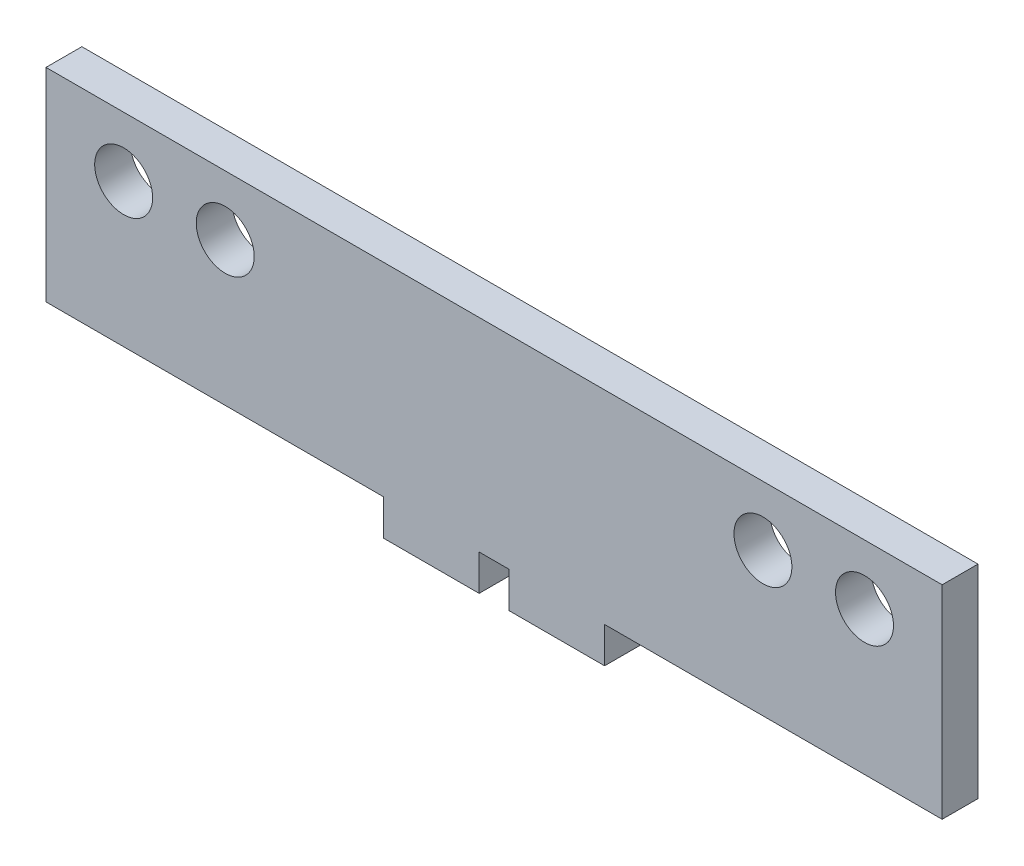
ISO-10303-21;
HEADER;
FILE_DESCRIPTION(('STEP AP214'),'2;1');
FILE_NAME('part.step','',(''),(''),'','','');
FILE_SCHEMA(('AUTOMOTIVE_DESIGN { 1 0 10303 214 1 1 1 1 }'));
ENDSEC;
DATA;
#1=APPLICATION_CONTEXT('core data for automotive mechanical design processes');
#2=APPLICATION_PROTOCOL_DEFINITION('international standard','automotive_design',2000,#1);
#3=PRODUCT_CONTEXT('',#1,'mechanical');
#4=PRODUCT('Part','Part','',(#3));
#5=PRODUCT_RELATED_PRODUCT_CATEGORY('part','',(#4));
#6=PRODUCT_DEFINITION_FORMATION('','',#4);
#7=PRODUCT_DEFINITION_CONTEXT('part definition',#1,'design');
#8=PRODUCT_DEFINITION('design','',#6,#7);
#9=PRODUCT_DEFINITION_SHAPE('','',#8);
#10=(LENGTH_UNIT() NAMED_UNIT(*) SI_UNIT(.MILLI.,.METRE.));
#11=(NAMED_UNIT(*) PLANE_ANGLE_UNIT() SI_UNIT($,.RADIAN.));
#12=(NAMED_UNIT(*) SI_UNIT($,.STERADIAN.) SOLID_ANGLE_UNIT());
#13=UNCERTAINTY_MEASURE_WITH_UNIT(LENGTH_MEASURE(1.E-05),#10,'distance_accuracy_value','');
#14=(GEOMETRIC_REPRESENTATION_CONTEXT(3) GLOBAL_UNCERTAINTY_ASSIGNED_CONTEXT((#13)) GLOBAL_UNIT_ASSIGNED_CONTEXT((#10,
#11,#12)) REPRESENTATION_CONTEXT('',''));
#15=CARTESIAN_POINT('',(0.,0.,0.));
#16=DIRECTION('',(0.,0.,1.));
#17=DIRECTION('',(1.,0.,0.));
#18=AXIS2_PLACEMENT_3D('',#15,#16,#17);
#19=CARTESIAN_POINT('',(-37.5,-8.5,3.));
#20=DIRECTION('',(0.,1.,0.));
#21=DIRECTION('',(0.,0.,1.));
#22=AXIS2_PLACEMENT_3D('',#19,#20,#21);
#23=PLANE('',#22);
#24=DIRECTION('',(0.,0.,1.));
#25=VECTOR('',#24,1.);
#26=CARTESIAN_POINT('',(9.24999999999999,-8.5,3.));
#27=LINE('',#26,#25);
#28=CARTESIAN_POINT('',(9.24999999999999,-8.5,0.));
#29=VERTEX_POINT('',#28);
#30=CARTESIAN_POINT('',(9.24999999999999,-8.5,3.));
#31=VERTEX_POINT('',#30);
#32=EDGE_CURVE('E145',#29,#31,#27,.T.);
#33=ORIENTED_EDGE('',*,*,#32,.F.);
#34=DIRECTION('',(1.,0.,0.));
#35=VECTOR('',#34,1.);
#36=CARTESIAN_POINT('',(-37.5,-8.5,0.));
#37=LINE('',#36,#35);
#38=CARTESIAN_POINT('',(37.5,-8.5,0.));
#39=VERTEX_POINT('',#38);
#40=EDGE_CURVE('E197',#29,#39,#37,.T.);
#41=ORIENTED_EDGE('',*,*,#40,.T.);
#42=DIRECTION('',(0.,0.,-1.));
#43=VECTOR('',#42,1.);
#44=CARTESIAN_POINT('',(37.5,-8.5,3.));
#45=LINE('',#44,#43);
#46=CARTESIAN_POINT('',(37.5,-8.5,3.));
#47=VERTEX_POINT('',#46);
#48=EDGE_CURVE('E189',#47,#39,#45,.T.);
#49=ORIENTED_EDGE('',*,*,#48,.F.);
#50=DIRECTION('',(1.,0.,0.));
#51=VECTOR('',#50,1.);
#52=CARTESIAN_POINT('',(-37.5,-8.5,3.));
#53=LINE('',#52,#51);
#54=EDGE_CURVE('E48',#31,#47,#53,.T.);
#55=ORIENTED_EDGE('',*,*,#54,.F.);
#56=EDGE_LOOP('',(#33,#41,#49,#55));
#57=FACE_BOUND('',#56,.T.);
#58=ADVANCED_FACE('F33',(#57),#23,.F.);
#59=DIRECTION('',(0.,0.,-1.));
#60=VECTOR('',#59,1.);
#61=CARTESIAN_POINT('',(1.24999999999999,-8.5,3.));
#62=LINE('',#61,#60);
#63=CARTESIAN_POINT('',(1.24999999999999,-8.5,3.));
#64=VERTEX_POINT('',#63);
#65=CARTESIAN_POINT('',(1.24999999999999,-8.5,0.));
#66=VERTEX_POINT('',#65);
#67=EDGE_CURVE('E56',#64,#66,#62,.T.);
#68=ORIENTED_EDGE('',*,*,#67,.F.);
#69=CARTESIAN_POINT('',(-1.25,-8.5,3.));
#70=VERTEX_POINT('',#69);
#71=EDGE_CURVE('E190',#70,#64,#53,.T.);
#72=ORIENTED_EDGE('',*,*,#71,.F.);
#73=DIRECTION('',(0.,0.,1.));
#74=VECTOR('',#73,1.);
#75=CARTESIAN_POINT('',(-1.25,-8.5,3.));
#76=LINE('',#75,#74);
#77=CARTESIAN_POINT('',(-1.25,-8.5,0.));
#78=VERTEX_POINT('',#77);
#79=EDGE_CURVE('E149',#78,#70,#76,.T.);
#80=ORIENTED_EDGE('',*,*,#79,.F.);
#81=EDGE_CURVE('E199',#78,#66,#37,.T.);
#82=ORIENTED_EDGE('',*,*,#81,.T.);
#83=EDGE_LOOP('',(#68,#72,#80,#82));
#84=FACE_BOUND('',#83,.T.);
#85=ADVANCED_FACE('F233',(#84),#23,.F.);
#86=DIRECTION('',(0.,0.,-1.));
#87=VECTOR('',#86,1.);
#88=CARTESIAN_POINT('',(-9.25000000000001,-8.5,3.));
#89=LINE('',#88,#87);
#90=CARTESIAN_POINT('',(-9.25000000000001,-8.5,3.));
#91=VERTEX_POINT('',#90);
#92=CARTESIAN_POINT('',(-9.25000000000001,-8.5,0.));
#93=VERTEX_POINT('',#92);
#94=EDGE_CURVE('E146',#91,#93,#89,.T.);
#95=ORIENTED_EDGE('',*,*,#94,.F.);
#96=CARTESIAN_POINT('',(-37.5,-8.5,3.));
#97=VERTEX_POINT('',#96);
#98=EDGE_CURVE('E186',#97,#91,#53,.T.);
#99=ORIENTED_EDGE('',*,*,#98,.F.);
#100=DIRECTION('',(0.,0.,-1.));
#101=VECTOR('',#100,1.);
#102=CARTESIAN_POINT('',(-37.5,-8.5,3.));
#103=LINE('',#102,#101);
#104=CARTESIAN_POINT('',(-37.5,-8.5,0.));
#105=VERTEX_POINT('',#104);
#106=EDGE_CURVE('E202',#97,#105,#103,.T.);
#107=ORIENTED_EDGE('',*,*,#106,.T.);
#108=EDGE_CURVE('E182',#105,#93,#37,.T.);
#109=ORIENTED_EDGE('',*,*,#108,.T.);
#110=EDGE_LOOP('',(#95,#99,#107,#109));
#111=FACE_BOUND('',#110,.T.);
#112=ADVANCED_FACE('F218',(#111),#23,.F.);
#113=CARTESIAN_POINT('',(37.5,8.5,3.));
#114=DIRECTION('',(-1.,0.,0.));
#115=DIRECTION('',(0.,0.,1.));
#116=AXIS2_PLACEMENT_3D('',#113,#114,#115);
#117=PLANE('',#116);
#118=DIRECTION('',(0.,1.,0.));
#119=VECTOR('',#118,1.);
#120=CARTESIAN_POINT('',(37.5,8.5,0.));
#121=LINE('',#120,#119);
#122=CARTESIAN_POINT('',(37.5,8.5,0.));
#123=VERTEX_POINT('',#122);
#124=EDGE_CURVE('E178',#39,#123,#121,.T.);
#125=ORIENTED_EDGE('',*,*,#124,.T.);
#126=DIRECTION('',(0.,0.,-1.));
#127=VECTOR('',#126,1.);
#128=CARTESIAN_POINT('',(37.5,8.5,3.));
#129=LINE('',#128,#127);
#130=CARTESIAN_POINT('',(37.5,8.5,3.));
#131=VERTEX_POINT('',#130);
#132=EDGE_CURVE('E11',#131,#123,#129,.T.);
#133=ORIENTED_EDGE('',*,*,#132,.F.);
#134=DIRECTION('',(0.,1.,0.));
#135=VECTOR('',#134,1.);
#136=CARTESIAN_POINT('',(37.5,8.5,3.));
#137=LINE('',#136,#135);
#138=EDGE_CURVE('E179',#47,#131,#137,.T.);
#139=ORIENTED_EDGE('',*,*,#138,.F.);
#140=ORIENTED_EDGE('',*,*,#48,.T.);
#141=EDGE_LOOP('',(#125,#133,#139,#140));
#142=FACE_BOUND('',#141,.T.);
#143=ADVANCED_FACE('F35',(#142),#117,.F.);
#144=CARTESIAN_POINT('',(-37.5,8.5,3.));
#145=DIRECTION('',(0.,-1.,0.));
#146=DIRECTION('',(0.,0.,-1.));
#147=AXIS2_PLACEMENT_3D('',#144,#145,#146);
#148=PLANE('',#147);
#149=DIRECTION('',(-1.,0.,0.));
#150=VECTOR('',#149,1.);
#151=CARTESIAN_POINT('',(-37.5,8.5,0.));
#152=LINE('',#151,#150);
#153=CARTESIAN_POINT('',(-37.5,8.5,0.));
#154=VERTEX_POINT('',#153);
#155=EDGE_CURVE('E193',#123,#154,#152,.T.);
#156=ORIENTED_EDGE('',*,*,#155,.T.);
#157=DIRECTION('',(0.,0.,-1.));
#158=VECTOR('',#157,1.);
#159=CARTESIAN_POINT('',(-37.5,8.5,3.));
#160=LINE('',#159,#158);
#161=CARTESIAN_POINT('',(-37.5,8.5,3.));
#162=VERTEX_POINT('',#161);
#163=EDGE_CURVE('E41',#162,#154,#160,.T.);
#164=ORIENTED_EDGE('',*,*,#163,.F.);
#165=DIRECTION('',(-1.,0.,0.));
#166=VECTOR('',#165,1.);
#167=CARTESIAN_POINT('',(-37.5,8.5,3.));
#168=LINE('',#167,#166);
#169=EDGE_CURVE('E181',#131,#162,#168,.T.);
#170=ORIENTED_EDGE('',*,*,#169,.F.);
#171=ORIENTED_EDGE('',*,*,#132,.T.);
#172=EDGE_LOOP('',(#156,#164,#170,#171));
#173=FACE_BOUND('',#172,.T.);
#174=ADVANCED_FACE('F239',(#173),#148,.F.);
#175=CARTESIAN_POINT('',(-37.5,8.5,3.));
#176=DIRECTION('',(1.,0.,0.));
#177=DIRECTION('',(0.,0.,-1.));
#178=AXIS2_PLACEMENT_3D('',#175,#176,#177);
#179=PLANE('',#178);
#180=DIRECTION('',(0.,-1.,0.));
#181=VECTOR('',#180,1.);
#182=CARTESIAN_POINT('',(-37.5,8.5,0.));
#183=LINE('',#182,#181);
#184=EDGE_CURVE('E195',#154,#105,#183,.T.);
#185=ORIENTED_EDGE('',*,*,#184,.T.);
#186=ORIENTED_EDGE('',*,*,#106,.F.);
#187=DIRECTION('',(0.,-1.,0.));
#188=VECTOR('',#187,1.);
#189=CARTESIAN_POINT('',(-37.5,8.5,3.));
#190=LINE('',#189,#188);
#191=EDGE_CURVE('E184',#162,#97,#190,.T.);
#192=ORIENTED_EDGE('',*,*,#191,.F.);
#193=ORIENTED_EDGE('',*,*,#163,.T.);
#194=EDGE_LOOP('',(#185,#186,#192,#193));
#195=FACE_BOUND('',#194,.T.);
#196=ADVANCED_FACE('F209',(#195),#179,.F.);
#197=CARTESIAN_POINT('',(0.,0.,3.));
#198=DIRECTION('',(0.,0.,1.));
#199=DIRECTION('',(1.,0.,0.));
#200=AXIS2_PLACEMENT_3D('',#197,#198,#199);
#201=PLANE('',#200);
#202=CARTESIAN_POINT('',(-31.,3.5,3.));
#203=DIRECTION('',(0.,0.,1.));
#204=DIRECTION('',(1.,0.,0.));
#205=AXIS2_PLACEMENT_3D('',#202,#203,#204);
#206=CIRCLE('',#205,2.425);
#207=CARTESIAN_POINT('',(-28.575,3.5,3.));
#208=VERTEX_POINT('',#207);
#209=EDGE_CURVE('E432',#208,#208,#206,.T.);
#210=ORIENTED_EDGE('',*,*,#209,.F.);
#211=EDGE_LOOP('',(#210));
#212=FACE_BOUND('',#211,.T.);
#213=CARTESIAN_POINT('',(-22.5,3.5,3.));
#214=DIRECTION('',(0.,0.,1.));
#215=DIRECTION('',(1.,0.,0.));
#216=AXIS2_PLACEMENT_3D('',#213,#214,#215);
#217=CIRCLE('',#216,2.425);
#218=CARTESIAN_POINT('',(-20.075,3.5,3.));
#219=VERTEX_POINT('',#218);
#220=EDGE_CURVE('E426',#219,#219,#217,.T.);
#221=ORIENTED_EDGE('',*,*,#220,.F.);
#222=EDGE_LOOP('',(#221));
#223=FACE_BOUND('',#222,.T.);
#224=CARTESIAN_POINT('',(22.5,3.5,3.));
#225=DIRECTION('',(0.,0.,1.));
#226=DIRECTION('',(1.,0.,0.));
#227=AXIS2_PLACEMENT_3D('',#224,#225,#226);
#228=CIRCLE('',#227,2.425);
#229=CARTESIAN_POINT('',(24.925,3.5,3.));
#230=VERTEX_POINT('',#229);
#231=EDGE_CURVE('E420',#230,#230,#228,.T.);
#232=ORIENTED_EDGE('',*,*,#231,.F.);
#233=EDGE_LOOP('',(#232));
#234=FACE_BOUND('',#233,.T.);
#235=CARTESIAN_POINT('',(31.,3.5,3.));
#236=DIRECTION('',(0.,0.,1.));
#237=DIRECTION('',(1.,0.,0.));
#238=AXIS2_PLACEMENT_3D('',#235,#236,#237);
#239=CIRCLE('',#238,2.425);
#240=CARTESIAN_POINT('',(33.425,3.5,3.));
#241=VERTEX_POINT('',#240);
#242=EDGE_CURVE('E414',#241,#241,#239,.T.);
#243=ORIENTED_EDGE('',*,*,#242,.F.);
#244=EDGE_LOOP('',(#243));
#245=FACE_BOUND('',#244,.T.);
#246=ORIENTED_EDGE('',*,*,#138,.T.);
#247=ORIENTED_EDGE('',*,*,#169,.T.);
#248=ORIENTED_EDGE('',*,*,#191,.T.);
#249=ORIENTED_EDGE('',*,*,#98,.T.);
#250=DIRECTION('',(0.,1.,0.));
#251=VECTOR('',#250,1.);
#252=CARTESIAN_POINT('',(-9.25000000000001,-11.5,3.));
#253=LINE('',#252,#251);
#254=CARTESIAN_POINT('',(-9.25000000000001,-11.5,3.));
#255=VERTEX_POINT('',#254);
#256=EDGE_CURVE('E163',#255,#91,#253,.T.);
#257=ORIENTED_EDGE('',*,*,#256,.F.);
#258=DIRECTION('',(-1.,0.,0.));
#259=VECTOR('',#258,1.);
#260=CARTESIAN_POINT('',(-9.25000000000001,-11.5,3.));
#261=LINE('',#260,#259);
#262=CARTESIAN_POINT('',(-1.25,-11.5,3.));
#263=VERTEX_POINT('',#262);
#264=EDGE_CURVE('E162',#263,#255,#261,.T.);
#265=ORIENTED_EDGE('',*,*,#264,.F.);
#266=DIRECTION('',(0.,1.,0.));
#267=VECTOR('',#266,1.);
#268=CARTESIAN_POINT('',(-1.25,-11.5,3.));
#269=LINE('',#268,#267);
#270=EDGE_CURVE('E169',#263,#70,#269,.T.);
#271=ORIENTED_EDGE('',*,*,#270,.T.);
#272=ORIENTED_EDGE('',*,*,#71,.T.);
#273=DIRECTION('',(0.,1.,0.));
#274=VECTOR('',#273,1.);
#275=CARTESIAN_POINT('',(1.24999999999999,-11.5,3.));
#276=LINE('',#275,#274);
#277=CARTESIAN_POINT('',(1.24999999999999,-11.5,3.));
#278=VERTEX_POINT('',#277);
#279=EDGE_CURVE('E130',#278,#64,#276,.T.);
#280=ORIENTED_EDGE('',*,*,#279,.F.);
#281=DIRECTION('',(-1.,0.,0.));
#282=VECTOR('',#281,1.);
#283=CARTESIAN_POINT('',(9.24999999999999,-11.5,3.));
#284=LINE('',#283,#282);
#285=CARTESIAN_POINT('',(9.24999999999999,-11.5,3.));
#286=VERTEX_POINT('',#285);
#287=EDGE_CURVE('E122',#286,#278,#284,.T.);
#288=ORIENTED_EDGE('',*,*,#287,.F.);
#289=DIRECTION('',(0.,1.,0.));
#290=VECTOR('',#289,1.);
#291=CARTESIAN_POINT('',(9.24999999999999,-11.5,3.));
#292=LINE('',#291,#290);
#293=EDGE_CURVE('E127',#286,#31,#292,.T.);
#294=ORIENTED_EDGE('',*,*,#293,.T.);
#295=ORIENTED_EDGE('',*,*,#54,.T.);
#296=EDGE_LOOP('',(#246,#247,#248,#249,#257,#265,#271,#272,#280,#288,#294,#295));
#297=FACE_BOUND('',#296,.T.);
#298=ADVANCED_FACE('F125',(#212,#223,#234,#245,#297),#201,.T.);
#299=CARTESIAN_POINT('',(0.,0.,0.));
#300=DIRECTION('',(0.,0.,1.));
#301=DIRECTION('',(1.,0.,0.));
#302=AXIS2_PLACEMENT_3D('',#299,#300,#301);
#303=PLANE('',#302);
#304=CARTESIAN_POINT('',(-31.,3.5,0.));
#305=DIRECTION('',(0.,0.,1.));
#306=DIRECTION('',(1.,0.,0.));
#307=AXIS2_PLACEMENT_3D('',#304,#305,#306);
#308=CIRCLE('',#307,2.425);
#309=CARTESIAN_POINT('',(-28.575,3.5,0.));
#310=VERTEX_POINT('',#309);
#311=EDGE_CURVE('E407',#310,#310,#308,.T.);
#312=ORIENTED_EDGE('',*,*,#311,.T.);
#313=EDGE_LOOP('',(#312));
#314=FACE_BOUND('',#313,.T.);
#315=CARTESIAN_POINT('',(-22.5,3.5,0.));
#316=DIRECTION('',(0.,0.,1.));
#317=DIRECTION('',(1.,0.,0.));
#318=AXIS2_PLACEMENT_3D('',#315,#316,#317);
#319=CIRCLE('',#318,2.425);
#320=CARTESIAN_POINT('',(-20.075,3.5,0.));
#321=VERTEX_POINT('',#320);
#322=EDGE_CURVE('E429',#321,#321,#319,.T.);
#323=ORIENTED_EDGE('',*,*,#322,.T.);
#324=EDGE_LOOP('',(#323));
#325=FACE_BOUND('',#324,.T.);
#326=CARTESIAN_POINT('',(22.5,3.5,0.));
#327=DIRECTION('',(0.,0.,1.));
#328=DIRECTION('',(1.,0.,0.));
#329=AXIS2_PLACEMENT_3D('',#326,#327,#328);
#330=CIRCLE('',#329,2.425);
#331=CARTESIAN_POINT('',(24.925,3.5,0.));
#332=VERTEX_POINT('',#331);
#333=EDGE_CURVE('E423',#332,#332,#330,.T.);
#334=ORIENTED_EDGE('',*,*,#333,.T.);
#335=EDGE_LOOP('',(#334));
#336=FACE_BOUND('',#335,.T.);
#337=CARTESIAN_POINT('',(31.,3.5,0.));
#338=DIRECTION('',(0.,0.,1.));
#339=DIRECTION('',(1.,0.,0.));
#340=AXIS2_PLACEMENT_3D('',#337,#338,#339);
#341=CIRCLE('',#340,2.425);
#342=CARTESIAN_POINT('',(33.425,3.5,0.));
#343=VERTEX_POINT('',#342);
#344=EDGE_CURVE('E417',#343,#343,#341,.T.);
#345=ORIENTED_EDGE('',*,*,#344,.T.);
#346=EDGE_LOOP('',(#345));
#347=FACE_BOUND('',#346,.T.);
#348=ORIENTED_EDGE('',*,*,#124,.F.);
#349=ORIENTED_EDGE('',*,*,#40,.F.);
#350=DIRECTION('',(0.,1.,0.));
#351=VECTOR('',#350,1.);
#352=CARTESIAN_POINT('',(9.24999999999999,-11.5,0.));
#353=LINE('',#352,#351);
#354=CARTESIAN_POINT('',(9.24999999999999,-11.5,0.));
#355=VERTEX_POINT('',#354);
#356=EDGE_CURVE('E411',#355,#29,#353,.T.);
#357=ORIENTED_EDGE('',*,*,#356,.F.);
#358=DIRECTION('',(1.,0.,0.));
#359=VECTOR('',#358,1.);
#360=CARTESIAN_POINT('',(9.24999999999999,-11.5,0.));
#361=LINE('',#360,#359);
#362=CARTESIAN_POINT('',(1.24999999999999,-11.5,0.));
#363=VERTEX_POINT('',#362);
#364=EDGE_CURVE('E139',#363,#355,#361,.T.);
#365=ORIENTED_EDGE('',*,*,#364,.F.);
#366=DIRECTION('',(0.,1.,0.));
#367=VECTOR('',#366,1.);
#368=CARTESIAN_POINT('',(1.24999999999999,-11.5,0.));
#369=LINE('',#368,#367);
#370=EDGE_CURVE('E151',#363,#66,#369,.T.);
#371=ORIENTED_EDGE('',*,*,#370,.T.);
#372=ORIENTED_EDGE('',*,*,#81,.F.);
#373=DIRECTION('',(0.,1.,0.));
#374=VECTOR('',#373,1.);
#375=CARTESIAN_POINT('',(-1.25,-11.5,0.));
#376=LINE('',#375,#374);
#377=CARTESIAN_POINT('',(-1.25,-11.5,0.));
#378=VERTEX_POINT('',#377);
#379=EDGE_CURVE('E172',#378,#78,#376,.T.);
#380=ORIENTED_EDGE('',*,*,#379,.F.);
#381=DIRECTION('',(1.,0.,0.));
#382=VECTOR('',#381,1.);
#383=CARTESIAN_POINT('',(-9.25000000000001,-11.5,0.));
#384=LINE('',#383,#382);
#385=CARTESIAN_POINT('',(-9.25000000000001,-11.5,0.));
#386=VERTEX_POINT('',#385);
#387=EDGE_CURVE('E158',#386,#378,#384,.T.);
#388=ORIENTED_EDGE('',*,*,#387,.F.);
#389=DIRECTION('',(0.,1.,0.));
#390=VECTOR('',#389,1.);
#391=CARTESIAN_POINT('',(-9.25000000000001,-11.5,0.));
#392=LINE('',#391,#390);
#393=EDGE_CURVE('E175',#386,#93,#392,.T.);
#394=ORIENTED_EDGE('',*,*,#393,.T.);
#395=ORIENTED_EDGE('',*,*,#108,.F.);
#396=ORIENTED_EDGE('',*,*,#184,.F.);
#397=ORIENTED_EDGE('',*,*,#155,.F.);
#398=EDGE_LOOP('',(#348,#349,#357,#365,#371,#372,#380,#388,#394,#395,#396,#397));
#399=FACE_BOUND('',#398,.T.);
#400=ADVANCED_FACE('F215',(#314,#325,#336,#347,#399),#303,.F.);
#401=CARTESIAN_POINT('',(-9.25000000000001,-11.5,3.));
#402=DIRECTION('',(1.,0.,0.));
#403=DIRECTION('',(0.,0.,-1.));
#404=AXIS2_PLACEMENT_3D('',#401,#402,#403);
#405=PLANE('',#404);
#406=ORIENTED_EDGE('',*,*,#94,.T.);
#407=ORIENTED_EDGE('',*,*,#393,.F.);
#408=DIRECTION('',(0.,0.,-1.));
#409=VECTOR('',#408,1.);
#410=CARTESIAN_POINT('',(-9.25000000000001,-11.5,3.));
#411=LINE('',#410,#409);
#412=EDGE_CURVE('E155',#255,#386,#411,.T.);
#413=ORIENTED_EDGE('',*,*,#412,.F.);
#414=ORIENTED_EDGE('',*,*,#256,.T.);
#415=EDGE_LOOP('',(#406,#407,#413,#414));
#416=FACE_BOUND('',#415,.T.);
#417=ADVANCED_FACE('F224',(#416),#405,.F.);
#418=CARTESIAN_POINT('',(-1.25,-11.5,3.));
#419=DIRECTION('',(-1.,0.,0.));
#420=DIRECTION('',(0.,0.,1.));
#421=AXIS2_PLACEMENT_3D('',#418,#419,#420);
#422=PLANE('',#421);
#423=ORIENTED_EDGE('',*,*,#79,.T.);
#424=ORIENTED_EDGE('',*,*,#270,.F.);
#425=DIRECTION('',(0.,0.,1.));
#426=VECTOR('',#425,1.);
#427=CARTESIAN_POINT('',(-1.25,-11.5,3.));
#428=LINE('',#427,#426);
#429=EDGE_CURVE('E160',#378,#263,#428,.T.);
#430=ORIENTED_EDGE('',*,*,#429,.F.);
#431=ORIENTED_EDGE('',*,*,#379,.T.);
#432=EDGE_LOOP('',(#423,#424,#430,#431));
#433=FACE_BOUND('',#432,.T.);
#434=ADVANCED_FACE('F231',(#433),#422,.F.);
#435=CARTESIAN_POINT('',(0.,-11.5,0.));
#436=DIRECTION('',(0.,-1.,0.));
#437=DIRECTION('',(0.,0.,-1.));
#438=AXIS2_PLACEMENT_3D('',#435,#436,#437);
#439=PLANE('',#438);
#440=ORIENTED_EDGE('',*,*,#412,.T.);
#441=ORIENTED_EDGE('',*,*,#387,.T.);
#442=ORIENTED_EDGE('',*,*,#429,.T.);
#443=ORIENTED_EDGE('',*,*,#264,.T.);
#444=EDGE_LOOP('',(#440,#441,#442,#443));
#445=FACE_BOUND('',#444,.T.);
#446=ADVANCED_FACE('F226',(#445),#439,.T.);
#447=CARTESIAN_POINT('',(9.24999999999999,-11.5,3.));
#448=DIRECTION('',(-1.,0.,0.));
#449=DIRECTION('',(0.,0.,1.));
#450=AXIS2_PLACEMENT_3D('',#447,#448,#449);
#451=PLANE('',#450);
#452=ORIENTED_EDGE('',*,*,#32,.T.);
#453=ORIENTED_EDGE('',*,*,#293,.F.);
#454=DIRECTION('',(0.,0.,1.));
#455=VECTOR('',#454,1.);
#456=CARTESIAN_POINT('',(9.24999999999999,-11.5,3.));
#457=LINE('',#456,#455);
#458=EDGE_CURVE('E134',#355,#286,#457,.T.);
#459=ORIENTED_EDGE('',*,*,#458,.F.);
#460=ORIENTED_EDGE('',*,*,#356,.T.);
#461=EDGE_LOOP('',(#452,#453,#459,#460));
#462=FACE_BOUND('',#461,.T.);
#463=ADVANCED_FACE('F144',(#462),#451,.F.);
#464=CARTESIAN_POINT('',(1.24999999999999,-11.5,3.));
#465=DIRECTION('',(1.,0.,0.));
#466=DIRECTION('',(0.,0.,-1.));
#467=AXIS2_PLACEMENT_3D('',#464,#465,#466);
#468=PLANE('',#467);
#469=ORIENTED_EDGE('',*,*,#67,.T.);
#470=ORIENTED_EDGE('',*,*,#370,.F.);
#471=DIRECTION('',(0.,0.,-1.));
#472=VECTOR('',#471,1.);
#473=CARTESIAN_POINT('',(1.24999999999999,-11.5,3.));
#474=LINE('',#473,#472);
#475=EDGE_CURVE('E133',#278,#363,#474,.T.);
#476=ORIENTED_EDGE('',*,*,#475,.F.);
#477=ORIENTED_EDGE('',*,*,#279,.T.);
#478=EDGE_LOOP('',(#469,#470,#476,#477));
#479=FACE_BOUND('',#478,.T.);
#480=ADVANCED_FACE('F366',(#479),#468,.F.);
#481=CARTESIAN_POINT('',(0.,-11.5,0.));
#482=DIRECTION('',(0.,1.,0.));
#483=DIRECTION('',(0.,0.,1.));
#484=AXIS2_PLACEMENT_3D('',#481,#482,#483);
#485=PLANE('',#484);
#486=ORIENTED_EDGE('',*,*,#458,.T.);
#487=ORIENTED_EDGE('',*,*,#287,.T.);
#488=ORIENTED_EDGE('',*,*,#475,.T.);
#489=ORIENTED_EDGE('',*,*,#364,.T.);
#490=EDGE_LOOP('',(#486,#487,#488,#489));
#491=FACE_BOUND('',#490,.T.);
#492=ADVANCED_FACE('F137',(#491),#485,.F.);
#493=CARTESIAN_POINT('',(31.,3.5,0.));
#494=DIRECTION('',(0.,0.,1.));
#495=DIRECTION('',(1.,0.,0.));
#496=AXIS2_PLACEMENT_3D('',#493,#494,#495);
#497=CYLINDRICAL_SURFACE('',#496,2.425);
#498=ORIENTED_EDGE('',*,*,#344,.F.);
#499=EDGE_LOOP('',(#498));
#500=FACE_BOUND('',#499,.T.);
#501=ORIENTED_EDGE('',*,*,#242,.T.);
#502=EDGE_LOOP('',(#501));
#503=FACE_BOUND('',#502,.T.);
#504=ADVANCED_FACE('F323',(#500,#503),#497,.F.);
#505=CARTESIAN_POINT('',(22.5,3.5,0.));
#506=DIRECTION('',(0.,0.,1.));
#507=DIRECTION('',(1.,0.,0.));
#508=AXIS2_PLACEMENT_3D('',#505,#506,#507);
#509=CYLINDRICAL_SURFACE('',#508,2.425);
#510=ORIENTED_EDGE('',*,*,#333,.F.);
#511=EDGE_LOOP('',(#510));
#512=FACE_BOUND('',#511,.T.);
#513=ORIENTED_EDGE('',*,*,#231,.T.);
#514=EDGE_LOOP('',(#513));
#515=FACE_BOUND('',#514,.T.);
#516=ADVANCED_FACE('F328',(#512,#515),#509,.F.);
#517=CARTESIAN_POINT('',(-22.5,3.5,0.));
#518=DIRECTION('',(0.,0.,1.));
#519=DIRECTION('',(1.,0.,0.));
#520=AXIS2_PLACEMENT_3D('',#517,#518,#519);
#521=CYLINDRICAL_SURFACE('',#520,2.425);
#522=ORIENTED_EDGE('',*,*,#322,.F.);
#523=EDGE_LOOP('',(#522));
#524=FACE_BOUND('',#523,.T.);
#525=ORIENTED_EDGE('',*,*,#220,.T.);
#526=EDGE_LOOP('',(#525));
#527=FACE_BOUND('',#526,.T.);
#528=ADVANCED_FACE('F338',(#524,#527),#521,.F.);
#529=CARTESIAN_POINT('',(-31.,3.5,0.));
#530=DIRECTION('',(0.,0.,1.));
#531=DIRECTION('',(1.,0.,0.));
#532=AXIS2_PLACEMENT_3D('',#529,#530,#531);
#533=CYLINDRICAL_SURFACE('',#532,2.425);
#534=ORIENTED_EDGE('',*,*,#311,.F.);
#535=EDGE_LOOP('',(#534));
#536=FACE_BOUND('',#535,.T.);
#537=ORIENTED_EDGE('',*,*,#209,.T.);
#538=EDGE_LOOP('',(#537));
#539=FACE_BOUND('',#538,.T.);
#540=ADVANCED_FACE('F348',(#536,#539),#533,.F.);
#541=CLOSED_SHELL('',(#58,#85,#112,#143,#174,#196,#298,#400,#417,#434,#446,#463,#480,#492,#504,
#516,#528,#540));
#542=MANIFOLD_SOLID_BREP('B2',#541);
#543=ADVANCED_BREP_SHAPE_REPRESENTATION('',(#18,#542),#14);
#544=SHAPE_DEFINITION_REPRESENTATION(#9,#543);
ENDSEC;
END-ISO-10303-21;
